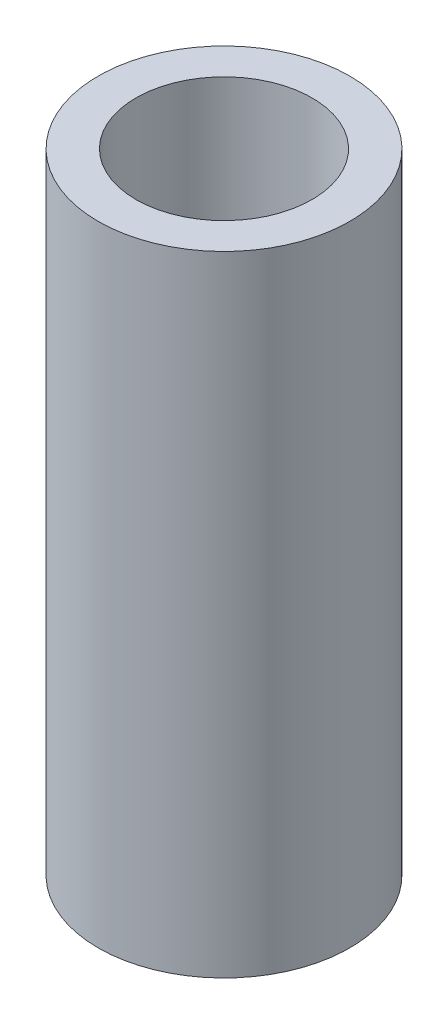
ISO-10303-21;
HEADER;
FILE_DESCRIPTION(('STEP AP214'),'2;1');
FILE_NAME('part.step','',(''),(''),'','','');
FILE_SCHEMA(('AUTOMOTIVE_DESIGN { 1 0 10303 214 1 1 1 1 }'));
ENDSEC;
DATA;
#1=APPLICATION_CONTEXT('core data for automotive mechanical design processes');
#2=APPLICATION_PROTOCOL_DEFINITION('international standard','automotive_design',2000,#1);
#3=PRODUCT_CONTEXT('',#1,'mechanical');
#4=PRODUCT('Part','Part','',(#3));
#5=PRODUCT_RELATED_PRODUCT_CATEGORY('part','',(#4));
#6=PRODUCT_DEFINITION_FORMATION('','',#4);
#7=PRODUCT_DEFINITION_CONTEXT('part definition',#1,'design');
#8=PRODUCT_DEFINITION('design','',#6,#7);
#9=PRODUCT_DEFINITION_SHAPE('','',#8);
#10=(LENGTH_UNIT() NAMED_UNIT(*) SI_UNIT(.MILLI.,.METRE.));
#11=(NAMED_UNIT(*) PLANE_ANGLE_UNIT() SI_UNIT($,.RADIAN.));
#12=(NAMED_UNIT(*) SI_UNIT($,.STERADIAN.) SOLID_ANGLE_UNIT());
#13=UNCERTAINTY_MEASURE_WITH_UNIT(LENGTH_MEASURE(1.E-05),#10,'distance_accuracy_value','');
#14=(GEOMETRIC_REPRESENTATION_CONTEXT(3) GLOBAL_UNCERTAINTY_ASSIGNED_CONTEXT((#13)) GLOBAL_UNIT_ASSIGNED_CONTEXT((#10,
#11,#12)) REPRESENTATION_CONTEXT('',''));
#15=CARTESIAN_POINT('',(0.,0.,0.));
#16=DIRECTION('',(0.,0.,1.));
#17=DIRECTION('',(1.,0.,0.));
#18=AXIS2_PLACEMENT_3D('',#15,#16,#17);
#19=CARTESIAN_POINT('',(0.,0.,0.));
#20=DIRECTION('',(0.,1.,0.));
#21=DIRECTION('',(0.,0.,1.));
#22=AXIS2_PLACEMENT_3D('',#19,#20,#21);
#23=CYLINDRICAL_SURFACE('',#22,4.);
#24=CARTESIAN_POINT('',(0.,0.,0.));
#25=DIRECTION('',(0.,1.,0.));
#26=DIRECTION('',(0.,0.,1.));
#27=AXIS2_PLACEMENT_3D('',#24,#25,#26);
#28=CIRCLE('',#27,4.);
#29=CARTESIAN_POINT('',(0.,0.,4.));
#30=VERTEX_POINT('',#29);
#31=EDGE_CURVE('E59',#30,#30,#28,.T.);
#32=ORIENTED_EDGE('',*,*,#31,.F.);
#33=EDGE_LOOP('',(#32));
#34=FACE_BOUND('',#33,.T.);
#35=CARTESIAN_POINT('',(0.,15.,0.));
#36=DIRECTION('',(0.,1.,0.));
#37=DIRECTION('',(0.,0.,1.));
#38=AXIS2_PLACEMENT_3D('',#35,#36,#37);
#39=CIRCLE('',#38,4.);
#40=CARTESIAN_POINT('',(0.,15.,4.));
#41=VERTEX_POINT('',#40);
#42=EDGE_CURVE('E50',#41,#41,#39,.F.);
#43=ORIENTED_EDGE('',*,*,#42,.F.);
#44=EDGE_LOOP('',(#43));
#45=FACE_BOUND('',#44,.T.);
#46=ADVANCED_FACE('F46',(#34,#45),#23,.F.);
#47=CARTESIAN_POINT('',(0.,50.,0.));
#48=DIRECTION('',(0.,-1.,0.));
#49=DIRECTION('',(0.,0.,-1.));
#50=AXIS2_PLACEMENT_3D('',#47,#48,#49);
#51=CYLINDRICAL_SURFACE('',#50,10.);
#52=CARTESIAN_POINT('',(0.,50.,0.));
#53=DIRECTION('',(0.,1.,0.));
#54=DIRECTION('',(0.,0.,1.));
#55=AXIS2_PLACEMENT_3D('',#52,#53,#54);
#56=CIRCLE('',#55,10.);
#57=CARTESIAN_POINT('',(0.,50.,10.));
#58=VERTEX_POINT('',#57);
#59=EDGE_CURVE('E12',#58,#58,#56,.T.);
#60=ORIENTED_EDGE('',*,*,#59,.F.);
#61=EDGE_LOOP('',(#60));
#62=FACE_BOUND('',#61,.T.);
#63=CARTESIAN_POINT('',(0.,0.,0.));
#64=DIRECTION('',(0.,1.,0.));
#65=DIRECTION('',(0.,0.,1.));
#66=AXIS2_PLACEMENT_3D('',#63,#64,#65);
#67=CIRCLE('',#66,10.);
#68=CARTESIAN_POINT('',(0.,0.,10.));
#69=VERTEX_POINT('',#68);
#70=EDGE_CURVE('E54',#69,#69,#67,.T.);
#71=ORIENTED_EDGE('',*,*,#70,.T.);
#72=EDGE_LOOP('',(#71));
#73=FACE_BOUND('',#72,.T.);
#74=ADVANCED_FACE('F48',(#62,#73),#51,.T.);
#75=CARTESIAN_POINT('',(0.,50.,0.));
#76=DIRECTION('',(0.,1.,0.));
#77=DIRECTION('',(0.,0.,1.));
#78=AXIS2_PLACEMENT_3D('',#75,#76,#77);
#79=PLANE('',#78);
#80=CARTESIAN_POINT('',(0.,50.,0.));
#81=DIRECTION('',(0.,1.,0.));
#82=DIRECTION('',(0.,0.,1.));
#83=AXIS2_PLACEMENT_3D('',#80,#81,#82);
#84=CIRCLE('',#83,7.);
#85=CARTESIAN_POINT('',(0.,50.,7.));
#86=VERTEX_POINT('',#85);
#87=EDGE_CURVE('E63',#86,#86,#84,.T.);
#88=ORIENTED_EDGE('',*,*,#87,.F.);
#89=EDGE_LOOP('',(#88));
#90=FACE_BOUND('',#89,.T.);
#91=ORIENTED_EDGE('',*,*,#59,.T.);
#92=EDGE_LOOP('',(#91));
#93=FACE_BOUND('',#92,.T.);
#94=ADVANCED_FACE('F81',(#90,#93),#79,.T.);
#95=CARTESIAN_POINT('',(0.,0.,0.));
#96=DIRECTION('',(0.,1.,0.));
#97=DIRECTION('',(0.,0.,1.));
#98=AXIS2_PLACEMENT_3D('',#95,#96,#97);
#99=PLANE('',#98);
#100=ORIENTED_EDGE('',*,*,#31,.T.);
#101=EDGE_LOOP('',(#100));
#102=FACE_BOUND('',#101,.T.);
#103=ORIENTED_EDGE('',*,*,#70,.F.);
#104=EDGE_LOOP('',(#103));
#105=FACE_BOUND('',#104,.T.);
#106=ADVANCED_FACE('F89',(#102,#105),#99,.F.);
#107=CARTESIAN_POINT('',(0.,15.,0.));
#108=DIRECTION('',(0.,1.,0.));
#109=DIRECTION('',(0.,0.,1.));
#110=AXIS2_PLACEMENT_3D('',#107,#108,#109);
#111=PLANE('',#110);
#112=CARTESIAN_POINT('',(0.,15.,0.));
#113=DIRECTION('',(0.,1.,0.));
#114=DIRECTION('',(0.,0.,1.));
#115=AXIS2_PLACEMENT_3D('',#112,#113,#114);
#116=CIRCLE('',#115,7.);
#117=CARTESIAN_POINT('',(0.,15.,7.));
#118=VERTEX_POINT('',#117);
#119=EDGE_CURVE('E66',#118,#118,#116,.T.);
#120=ORIENTED_EDGE('',*,*,#119,.T.);
#121=EDGE_LOOP('',(#120));
#122=FACE_BOUND('',#121,.T.);
#123=ORIENTED_EDGE('',*,*,#42,.T.);
#124=EDGE_LOOP('',(#123));
#125=FACE_BOUND('',#124,.T.);
#126=ADVANCED_FACE('F73',(#122,#125),#111,.T.);
#127=CARTESIAN_POINT('',(0.,15.,0.));
#128=DIRECTION('',(0.,1.,0.));
#129=DIRECTION('',(0.,0.,1.));
#130=AXIS2_PLACEMENT_3D('',#127,#128,#129);
#131=CYLINDRICAL_SURFACE('',#130,7.);
#132=ORIENTED_EDGE('',*,*,#119,.F.);
#133=EDGE_LOOP('',(#132));
#134=FACE_BOUND('',#133,.T.);
#135=ORIENTED_EDGE('',*,*,#87,.T.);
#136=EDGE_LOOP('',(#135));
#137=FACE_BOUND('',#136,.T.);
#138=ADVANCED_FACE('F86',(#134,#137),#131,.F.);
#139=CLOSED_SHELL('',(#46,#74,#94,#106,#126,#138));
#140=MANIFOLD_SOLID_BREP('B2',#139);
#141=ADVANCED_BREP_SHAPE_REPRESENTATION('',(#18,#140),#14);
#142=SHAPE_DEFINITION_REPRESENTATION(#9,#141);
ENDSEC;
END-ISO-10303-21;
